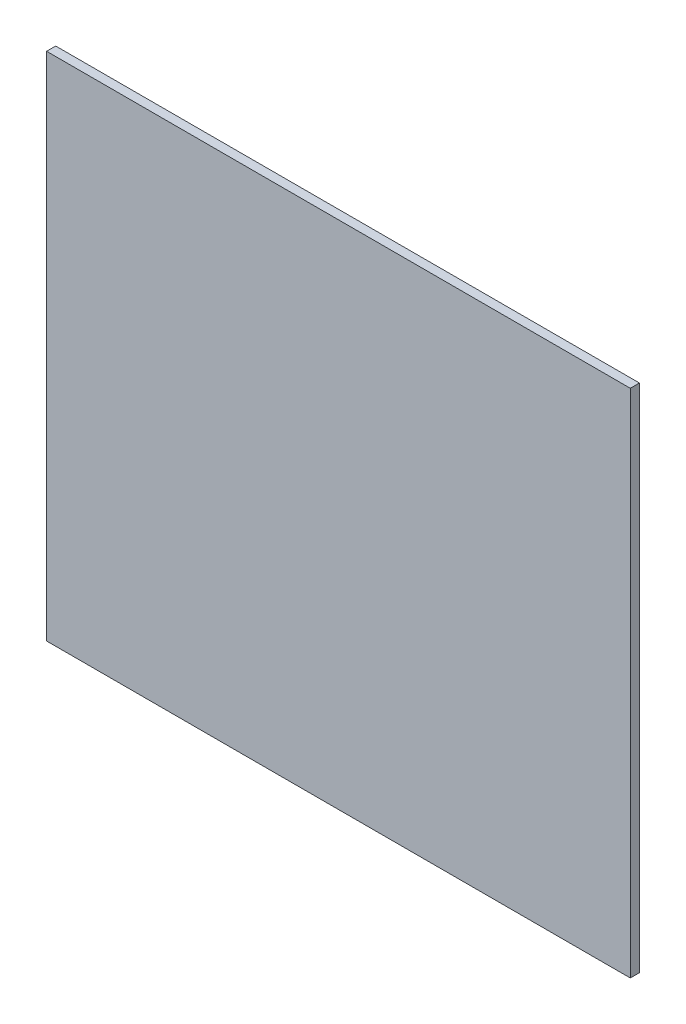
ISO-10303-21;
HEADER;
FILE_DESCRIPTION(('STEP AP214'),'2;1');
FILE_NAME('part.step','',(''),(''),'','','');
FILE_SCHEMA(('AUTOMOTIVE_DESIGN { 1 0 10303 214 1 1 1 1 }'));
ENDSEC;
DATA;
#1=APPLICATION_CONTEXT('core data for automotive mechanical design processes');
#2=APPLICATION_PROTOCOL_DEFINITION('international standard','automotive_design',2000,#1);
#3=PRODUCT_CONTEXT('',#1,'mechanical');
#4=PRODUCT('Part','Part','',(#3));
#5=PRODUCT_RELATED_PRODUCT_CATEGORY('part','',(#4));
#6=PRODUCT_DEFINITION_FORMATION('','',#4);
#7=PRODUCT_DEFINITION_CONTEXT('part definition',#1,'design');
#8=PRODUCT_DEFINITION('design','',#6,#7);
#9=PRODUCT_DEFINITION_SHAPE('','',#8);
#10=(LENGTH_UNIT() NAMED_UNIT(*) SI_UNIT(.MILLI.,.METRE.));
#11=(NAMED_UNIT(*) PLANE_ANGLE_UNIT() SI_UNIT($,.RADIAN.));
#12=(NAMED_UNIT(*) SI_UNIT($,.STERADIAN.) SOLID_ANGLE_UNIT());
#13=UNCERTAINTY_MEASURE_WITH_UNIT(LENGTH_MEASURE(1.E-05),#10,'distance_accuracy_value','');
#14=(GEOMETRIC_REPRESENTATION_CONTEXT(3) GLOBAL_UNCERTAINTY_ASSIGNED_CONTEXT((#13)) GLOBAL_UNIT_ASSIGNED_CONTEXT((#10,
#11,#12)) REPRESENTATION_CONTEXT('',''));
#15=CARTESIAN_POINT('',(0.,0.,0.));
#16=DIRECTION('',(0.,0.,1.));
#17=DIRECTION('',(1.,0.,0.));
#18=AXIS2_PLACEMENT_3D('',#15,#16,#17);
#19=CARTESIAN_POINT('',(-35.6801112656467,24.7287899860918,3.175));
#20=DIRECTION('',(1.,0.,0.));
#21=DIRECTION('',(0.,1.,0.));
#22=AXIS2_PLACEMENT_3D('',#19,#20,#21);
#23=PLANE('',#22);
#24=DIRECTION('',(0.,-1.,0.));
#25=VECTOR('',#24,1.);
#26=CARTESIAN_POINT('',(-35.6801112656467,24.7287899860918,0.));
#27=LINE('',#26,#25);
#28=CARTESIAN_POINT('',(-35.6801112656467,24.7287899860918,0.));
#29=VERTEX_POINT('',#28);
#30=CARTESIAN_POINT('',(-35.6801112656467,-153.071210013908,0.));
#31=VERTEX_POINT('',#30);
#32=EDGE_CURVE('E107',#29,#31,#27,.T.);
#33=ORIENTED_EDGE('',*,*,#32,.T.);
#34=DIRECTION('',(0.,0.,-1.));
#35=VECTOR('',#34,1.);
#36=CARTESIAN_POINT('',(-35.6801112656467,-153.071210013908,3.175));
#37=LINE('',#36,#35);
#38=CARTESIAN_POINT('',(-35.6801112656467,-153.071210013908,3.175));
#39=VERTEX_POINT('',#38);
#40=EDGE_CURVE('E11',#39,#31,#37,.T.);
#41=ORIENTED_EDGE('',*,*,#40,.F.);
#42=DIRECTION('',(0.,-1.,0.));
#43=VECTOR('',#42,1.);
#44=CARTESIAN_POINT('',(-35.6801112656467,24.7287899860918,3.175));
#45=LINE('',#44,#43);
#46=CARTESIAN_POINT('',(-35.6801112656467,24.7287899860918,3.175));
#47=VERTEX_POINT('',#46);
#48=EDGE_CURVE('E91',#47,#39,#45,.T.);
#49=ORIENTED_EDGE('',*,*,#48,.F.);
#50=DIRECTION('',(0.,0.,-1.));
#51=VECTOR('',#50,1.);
#52=CARTESIAN_POINT('',(-35.6801112656467,24.7287899860918,3.175));
#53=LINE('',#52,#51);
#54=EDGE_CURVE('E103',#47,#29,#53,.T.);
#55=ORIENTED_EDGE('',*,*,#54,.T.);
#56=EDGE_LOOP('',(#33,#41,#49,#55));
#57=FACE_BOUND('',#56,.T.);
#58=ADVANCED_FACE('F39',(#57),#23,.F.);
#59=CARTESIAN_POINT('',(-35.6801112656467,-153.071210013908,3.175));
#60=DIRECTION('',(0.,1.,0.));
#61=DIRECTION('',(0.,0.,1.));
#62=AXIS2_PLACEMENT_3D('',#59,#60,#61);
#63=PLANE('',#62);
#64=DIRECTION('',(1.,0.,0.));
#65=VECTOR('',#64,1.);
#66=CARTESIAN_POINT('',(-35.6801112656467,-153.071210013908,0.));
#67=LINE('',#66,#65);
#68=CARTESIAN_POINT('',(167.519888734353,-153.071210013908,0.));
#69=VERTEX_POINT('',#68);
#70=EDGE_CURVE('E96',#31,#69,#67,.T.);
#71=ORIENTED_EDGE('',*,*,#70,.T.);
#72=DIRECTION('',(0.,0.,-1.));
#73=VECTOR('',#72,1.);
#74=CARTESIAN_POINT('',(167.519888734353,-153.071210013908,3.175));
#75=LINE('',#74,#73);
#76=CARTESIAN_POINT('',(167.519888734353,-153.071210013908,3.175));
#77=VERTEX_POINT('',#76);
#78=EDGE_CURVE('E48',#77,#69,#75,.T.);
#79=ORIENTED_EDGE('',*,*,#78,.F.);
#80=DIRECTION('',(1.,0.,0.));
#81=VECTOR('',#80,1.);
#82=CARTESIAN_POINT('',(-35.6801112656467,-153.071210013908,3.175));
#83=LINE('',#82,#81);
#84=EDGE_CURVE('E86',#39,#77,#83,.T.);
#85=ORIENTED_EDGE('',*,*,#84,.F.);
#86=ORIENTED_EDGE('',*,*,#40,.T.);
#87=EDGE_LOOP('',(#71,#79,#85,#86));
#88=FACE_BOUND('',#87,.T.);
#89=ADVANCED_FACE('F95',(#88),#63,.F.);
#90=CARTESIAN_POINT('',(167.519888734353,24.7287899860918,3.175));
#91=DIRECTION('',(-1.,0.,0.));
#92=DIRECTION('',(0.,-1.,0.));
#93=AXIS2_PLACEMENT_3D('',#90,#91,#92);
#94=PLANE('',#93);
#95=DIRECTION('',(0.,1.,0.));
#96=VECTOR('',#95,1.);
#97=CARTESIAN_POINT('',(167.519888734353,24.7287899860918,0.));
#98=LINE('',#97,#96);
#99=CARTESIAN_POINT('',(167.519888734353,24.7287899860918,0.));
#100=VERTEX_POINT('',#99);
#101=EDGE_CURVE('E73',#69,#100,#98,.T.);
#102=ORIENTED_EDGE('',*,*,#101,.T.);
#103=DIRECTION('',(0.,0.,-1.));
#104=VECTOR('',#103,1.);
#105=CARTESIAN_POINT('',(167.519888734353,24.7287899860918,3.175));
#106=LINE('',#105,#104);
#107=CARTESIAN_POINT('',(167.519888734353,24.7287899860918,3.175));
#108=VERTEX_POINT('',#107);
#109=EDGE_CURVE('E98',#108,#100,#106,.T.);
#110=ORIENTED_EDGE('',*,*,#109,.F.);
#111=DIRECTION('',(0.,1.,0.));
#112=VECTOR('',#111,1.);
#113=CARTESIAN_POINT('',(167.519888734353,24.7287899860918,3.175));
#114=LINE('',#113,#112);
#115=EDGE_CURVE('E89',#77,#108,#114,.T.);
#116=ORIENTED_EDGE('',*,*,#115,.F.);
#117=ORIENTED_EDGE('',*,*,#78,.T.);
#118=EDGE_LOOP('',(#102,#110,#116,#117));
#119=FACE_BOUND('',#118,.T.);
#120=ADVANCED_FACE('F99',(#119),#94,.F.);
#121=CARTESIAN_POINT('',(-35.6801112656467,24.7287899860918,3.175));
#122=DIRECTION('',(0.,-1.,0.));
#123=DIRECTION('',(0.,0.,-1.));
#124=AXIS2_PLACEMENT_3D('',#121,#122,#123);
#125=PLANE('',#124);
#126=DIRECTION('',(-1.,0.,0.));
#127=VECTOR('',#126,1.);
#128=CARTESIAN_POINT('',(-35.6801112656467,24.7287899860918,0.));
#129=LINE('',#128,#127);
#130=EDGE_CURVE('E79',#100,#29,#129,.T.);
#131=ORIENTED_EDGE('',*,*,#130,.T.);
#132=ORIENTED_EDGE('',*,*,#54,.F.);
#133=DIRECTION('',(-1.,0.,0.));
#134=VECTOR('',#133,1.);
#135=CARTESIAN_POINT('',(-35.6801112656467,24.7287899860918,3.175));
#136=LINE('',#135,#134);
#137=EDGE_CURVE('E56',#108,#47,#136,.T.);
#138=ORIENTED_EDGE('',*,*,#137,.F.);
#139=ORIENTED_EDGE('',*,*,#109,.T.);
#140=EDGE_LOOP('',(#131,#132,#138,#139));
#141=FACE_BOUND('',#140,.T.);
#142=ADVANCED_FACE('F120',(#141),#125,.F.);
#143=CARTESIAN_POINT('',(0.,0.,3.175));
#144=DIRECTION('',(0.,0.,1.));
#145=DIRECTION('',(1.,0.,0.));
#146=AXIS2_PLACEMENT_3D('',#143,#144,#145);
#147=PLANE('',#146);
#148=ORIENTED_EDGE('',*,*,#48,.T.);
#149=ORIENTED_EDGE('',*,*,#84,.T.);
#150=ORIENTED_EDGE('',*,*,#115,.T.);
#151=ORIENTED_EDGE('',*,*,#137,.T.);
#152=EDGE_LOOP('',(#148,#149,#150,#151));
#153=FACE_BOUND('',#152,.T.);
#154=ADVANCED_FACE('F87',(#153),#147,.T.);
#155=CARTESIAN_POINT('',(0.,0.,0.));
#156=DIRECTION('',(0.,0.,1.));
#157=DIRECTION('',(1.,0.,0.));
#158=AXIS2_PLACEMENT_3D('',#155,#156,#157);
#159=PLANE('',#158);
#160=ORIENTED_EDGE('',*,*,#32,.F.);
#161=ORIENTED_EDGE('',*,*,#130,.F.);
#162=ORIENTED_EDGE('',*,*,#101,.F.);
#163=ORIENTED_EDGE('',*,*,#70,.F.);
#164=EDGE_LOOP('',(#160,#161,#162,#163));
#165=FACE_BOUND('',#164,.T.);
#166=ADVANCED_FACE('F123',(#165),#159,.F.);
#167=CLOSED_SHELL('',(#58,#89,#120,#142,#154,#166));
#168=MANIFOLD_SOLID_BREP('B2',#167);
#169=ADVANCED_BREP_SHAPE_REPRESENTATION('',(#18,#168),#14);
#170=SHAPE_DEFINITION_REPRESENTATION(#9,#169);
ENDSEC;
END-ISO-10303-21;
